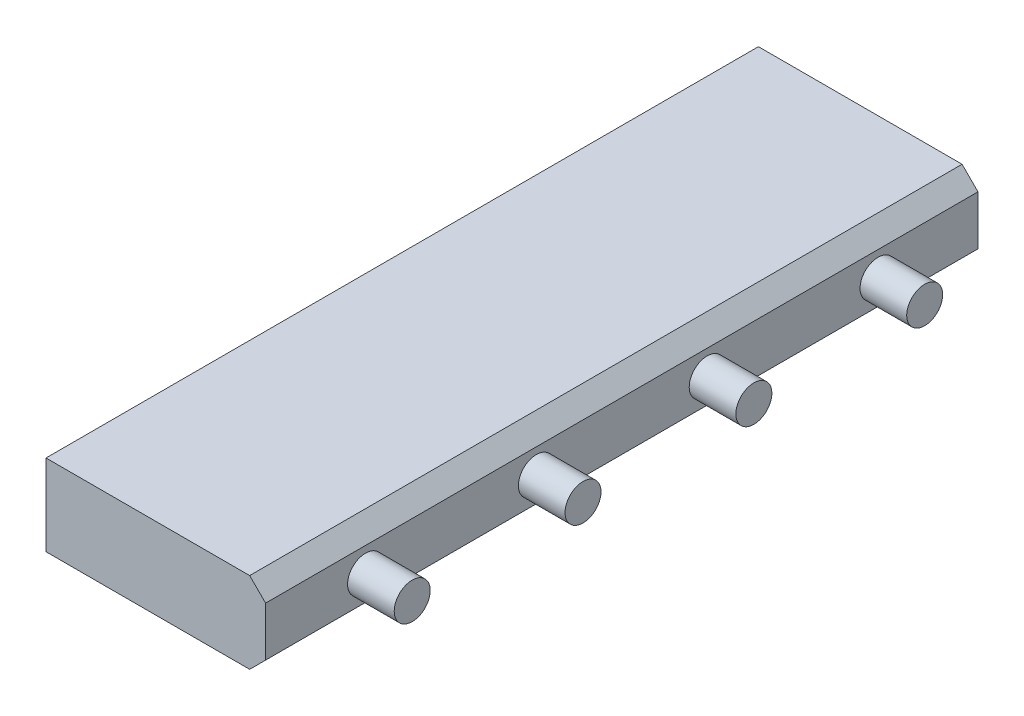
ISO-10303-21;
HEADER;
FILE_DESCRIPTION(('STEP AP214'),'2;1');
FILE_NAME('part.step','',(''),(''),'','','');
FILE_SCHEMA(('AUTOMOTIVE_DESIGN { 1 0 10303 214 1 1 1 1 }'));
ENDSEC;
DATA;
#1=APPLICATION_CONTEXT('core data for automotive mechanical design processes');
#2=APPLICATION_PROTOCOL_DEFINITION('international standard','automotive_design',2000,#1);
#3=PRODUCT_CONTEXT('',#1,'mechanical');
#4=PRODUCT('Part','Part','',(#3));
#5=PRODUCT_RELATED_PRODUCT_CATEGORY('part','',(#4));
#6=PRODUCT_DEFINITION_FORMATION('','',#4);
#7=PRODUCT_DEFINITION_CONTEXT('part definition',#1,'design');
#8=PRODUCT_DEFINITION('design','',#6,#7);
#9=PRODUCT_DEFINITION_SHAPE('','',#8);
#10=(LENGTH_UNIT() NAMED_UNIT(*) SI_UNIT(.MILLI.,.METRE.));
#11=(NAMED_UNIT(*) PLANE_ANGLE_UNIT() SI_UNIT($,.RADIAN.));
#12=(NAMED_UNIT(*) SI_UNIT($,.STERADIAN.) SOLID_ANGLE_UNIT());
#13=UNCERTAINTY_MEASURE_WITH_UNIT(LENGTH_MEASURE(1.E-05),#10,'distance_accuracy_value','');
#14=(GEOMETRIC_REPRESENTATION_CONTEXT(3) GLOBAL_UNCERTAINTY_ASSIGNED_CONTEXT((#13)) GLOBAL_UNIT_ASSIGNED_CONTEXT((#10,
#11,#12)) REPRESENTATION_CONTEXT('',''));
#15=CARTESIAN_POINT('',(0.,0.,0.));
#16=DIRECTION('',(0.,0.,1.));
#17=DIRECTION('',(1.,0.,0.));
#18=AXIS2_PLACEMENT_3D('',#15,#16,#17);
#19=CARTESIAN_POINT('',(0.,0.24375,2.138));
#20=DIRECTION('',(1.,0.,0.));
#21=DIRECTION('',(0.,0.,-1.));
#22=AXIS2_PLACEMENT_3D('',#19,#20,#21);
#23=PLANE('',#22);
#24=DIRECTION('',(0.,-1.,0.));
#25=VECTOR('',#24,1.);
#26=CARTESIAN_POINT('',(0.,0.24375,0.));
#27=LINE('',#26,#25);
#28=CARTESIAN_POINT('',(0.,0.24375,0.));
#29=VERTEX_POINT('',#28);
#30=CARTESIAN_POINT('',(0.,0.,0.));
#31=VERTEX_POINT('',#30);
#32=EDGE_CURVE('E129',#29,#31,#27,.T.);
#33=ORIENTED_EDGE('',*,*,#32,.T.);
#34=DIRECTION('',(0.,0.,-1.));
#35=VECTOR('',#34,1.);
#36=CARTESIAN_POINT('',(0.,0.,2.138));
#37=LINE('',#36,#35);
#38=CARTESIAN_POINT('',(0.,0.,2.138));
#39=VERTEX_POINT('',#38);
#40=EDGE_CURVE('E157',#39,#31,#37,.T.);
#41=ORIENTED_EDGE('',*,*,#40,.F.);
#42=DIRECTION('',(0.,-1.,0.));
#43=VECTOR('',#42,1.);
#44=CARTESIAN_POINT('',(0.,0.24375,2.138));
#45=LINE('',#44,#43);
#46=CARTESIAN_POINT('',(0.,0.24375,2.138));
#47=VERTEX_POINT('',#46);
#48=EDGE_CURVE('E146',#47,#39,#45,.T.);
#49=ORIENTED_EDGE('',*,*,#48,.F.);
#50=DIRECTION('',(0.,0.,-1.));
#51=VECTOR('',#50,1.);
#52=CARTESIAN_POINT('',(0.,0.24375,2.138));
#53=LINE('',#52,#51);
#54=EDGE_CURVE('E125',#47,#29,#53,.T.);
#55=ORIENTED_EDGE('',*,*,#54,.T.);
#56=EDGE_LOOP('',(#33,#41,#49,#55));
#57=FACE_BOUND('',#56,.T.);
#58=ADVANCED_FACE('F39',(#57),#23,.F.);
#59=CARTESIAN_POINT('',(0.,0.,2.138));
#60=DIRECTION('',(0.,1.,0.));
#61=DIRECTION('',(-1.,0.,0.));
#62=AXIS2_PLACEMENT_3D('',#59,#60,#61);
#63=PLANE('',#62);
#64=DIRECTION('',(1.,0.,0.));
#65=VECTOR('',#64,1.);
#66=CARTESIAN_POINT('',(0.,0.,0.));
#67=LINE('',#66,#65);
#68=CARTESIAN_POINT('',(0.61123,0.,0.));
#69=VERTEX_POINT('',#68);
#70=EDGE_CURVE('E133',#31,#69,#67,.T.);
#71=ORIENTED_EDGE('',*,*,#70,.T.);
#72=DIRECTION('',(0.,0.,-1.));
#73=VECTOR('',#72,1.);
#74=CARTESIAN_POINT('',(0.61123,0.,2.138));
#75=LINE('',#74,#73);
#76=CARTESIAN_POINT('',(0.61123,0.,2.138));
#77=VERTEX_POINT('',#76);
#78=EDGE_CURVE('E153',#77,#69,#75,.T.);
#79=ORIENTED_EDGE('',*,*,#78,.F.);
#80=DIRECTION('',(1.,0.,0.));
#81=VECTOR('',#80,1.);
#82=CARTESIAN_POINT('',(0.,0.,2.138));
#83=LINE('',#82,#81);
#84=EDGE_CURVE('E94',#39,#77,#83,.T.);
#85=ORIENTED_EDGE('',*,*,#84,.F.);
#86=ORIENTED_EDGE('',*,*,#40,.T.);
#87=EDGE_LOOP('',(#71,#79,#85,#86));
#88=FACE_BOUND('',#87,.T.);
#89=ADVANCED_FACE('F200',(#88),#63,.F.);
#90=CARTESIAN_POINT('',(0.61123,0.,2.138));
#91=DIRECTION('',(-0.707106781186549,0.707106781186546,0.));
#92=DIRECTION('',(-0.707106781186546,-0.707106781186549,0.));
#93=AXIS2_PLACEMENT_3D('',#90,#91,#92);
#94=PLANE('',#93);
#95=DIRECTION('',(0.707106781186546,0.707106781186549,0.));
#96=VECTOR('',#95,1.);
#97=CARTESIAN_POINT('',(0.61123,0.,0.));
#98=LINE('',#97,#96);
#99=CARTESIAN_POINT('',(0.659,0.0477700000000002,0.));
#100=VERTEX_POINT('',#99);
#101=EDGE_CURVE('E137',#69,#100,#98,.T.);
#102=ORIENTED_EDGE('',*,*,#101,.T.);
#103=DIRECTION('',(0.,0.,-1.));
#104=VECTOR('',#103,1.);
#105=CARTESIAN_POINT('',(0.659,0.0477700000000002,2.138));
#106=LINE('',#105,#104);
#107=CARTESIAN_POINT('',(0.659,0.0477700000000002,2.138));
#108=VERTEX_POINT('',#107);
#109=EDGE_CURVE('E118',#108,#100,#106,.T.);
#110=ORIENTED_EDGE('',*,*,#109,.F.);
#111=DIRECTION('',(0.707106781186546,0.707106781186549,0.));
#112=VECTOR('',#111,1.);
#113=CARTESIAN_POINT('',(0.61123,0.,2.138));
#114=LINE('',#113,#112);
#115=EDGE_CURVE('E107',#77,#108,#114,.T.);
#116=ORIENTED_EDGE('',*,*,#115,.F.);
#117=ORIENTED_EDGE('',*,*,#78,.T.);
#118=EDGE_LOOP('',(#102,#110,#116,#117));
#119=FACE_BOUND('',#118,.T.);
#120=ADVANCED_FACE('F175',(#119),#94,.F.);
#121=CARTESIAN_POINT('',(0.659,0.19598,2.138));
#122=DIRECTION('',(-1.,0.,0.));
#123=DIRECTION('',(0.,0.,1.));
#124=AXIS2_PLACEMENT_3D('',#121,#122,#123);
#125=PLANE('',#124);
#126=CARTESIAN_POINT('',(0.659,0.121875,0.3));
#127=DIRECTION('',(-1.,0.,0.));
#128=DIRECTION('',(0.,0.,1.));
#129=AXIS2_PLACEMENT_3D('',#126,#127,#128);
#130=CIRCLE('',#129,0.0540072996720412);
#131=CARTESIAN_POINT('',(0.659,0.121875,0.354007299672041));
#132=VERTEX_POINT('',#131);
#133=EDGE_CURVE('E11',#132,#132,#130,.F.);
#134=ORIENTED_EDGE('',*,*,#133,.F.);
#135=EDGE_LOOP('',(#134));
#136=FACE_BOUND('',#135,.T.);
#137=CARTESIAN_POINT('',(0.659,0.121875,1.838));
#138=DIRECTION('',(-1.,0.,0.));
#139=DIRECTION('',(0.,0.,1.));
#140=AXIS2_PLACEMENT_3D('',#137,#138,#139);
#141=CIRCLE('',#140,0.054007299672041);
#142=CARTESIAN_POINT('',(0.659,0.121875,1.89200729967204));
#143=VERTEX_POINT('',#142);
#144=EDGE_CURVE('E48',#143,#143,#141,.F.);
#145=ORIENTED_EDGE('',*,*,#144,.F.);
#146=EDGE_LOOP('',(#145));
#147=FACE_BOUND('',#146,.T.);
#148=CARTESIAN_POINT('',(0.659,0.121875,0.812666666666667));
#149=DIRECTION('',(-1.,0.,0.));
#150=DIRECTION('',(0.,0.,1.));
#151=AXIS2_PLACEMENT_3D('',#148,#149,#150);
#152=CIRCLE('',#151,0.0540072996720411);
#153=CARTESIAN_POINT('',(0.659,0.121875,0.866673966338708));
#154=VERTEX_POINT('',#153);
#155=EDGE_CURVE('E164',#154,#154,#152,.F.);
#156=ORIENTED_EDGE('',*,*,#155,.F.);
#157=EDGE_LOOP('',(#156));
#158=FACE_BOUND('',#157,.T.);
#159=CARTESIAN_POINT('',(0.659,0.121875,1.32533333333333));
#160=DIRECTION('',(-1.,0.,0.));
#161=DIRECTION('',(0.,0.,1.));
#162=AXIS2_PLACEMENT_3D('',#159,#160,#161);
#163=CIRCLE('',#162,0.054007299672041);
#164=CARTESIAN_POINT('',(0.659,0.121875,1.37934063300537));
#165=VERTEX_POINT('',#164);
#166=EDGE_CURVE('E160',#165,#165,#163,.F.);
#167=ORIENTED_EDGE('',*,*,#166,.F.);
#168=EDGE_LOOP('',(#167));
#169=FACE_BOUND('',#168,.T.);
#170=DIRECTION('',(0.,1.,0.));
#171=VECTOR('',#170,1.);
#172=CARTESIAN_POINT('',(0.659,0.19598,0.));
#173=LINE('',#172,#171);
#174=CARTESIAN_POINT('',(0.659,0.19598,0.));
#175=VERTEX_POINT('',#174);
#176=EDGE_CURVE('E116',#100,#175,#173,.T.);
#177=ORIENTED_EDGE('',*,*,#176,.T.);
#178=DIRECTION('',(0.,0.,-1.));
#179=VECTOR('',#178,1.);
#180=CARTESIAN_POINT('',(0.659,0.19598,2.138));
#181=LINE('',#180,#179);
#182=CARTESIAN_POINT('',(0.659,0.19598,2.138));
#183=VERTEX_POINT('',#182);
#184=EDGE_CURVE('E113',#183,#175,#181,.T.);
#185=ORIENTED_EDGE('',*,*,#184,.F.);
#186=DIRECTION('',(0.,1.,0.));
#187=VECTOR('',#186,1.);
#188=CARTESIAN_POINT('',(0.659,0.19598,2.138));
#189=LINE('',#188,#187);
#190=EDGE_CURVE('E101',#108,#183,#189,.T.);
#191=ORIENTED_EDGE('',*,*,#190,.F.);
#192=ORIENTED_EDGE('',*,*,#109,.T.);
#193=EDGE_LOOP('',(#177,#185,#191,#192));
#194=FACE_BOUND('',#193,.T.);
#195=ADVANCED_FACE('F114',(#136,#147,#158,#169,#194),#125,.F.);
#196=CARTESIAN_POINT('',(0.61123,0.24375,2.138));
#197=DIRECTION('',(-0.707106781186548,-0.707106781186547,0.));
#198=DIRECTION('',(0.707106781186547,-0.707106781186548,0.));
#199=AXIS2_PLACEMENT_3D('',#196,#197,#198);
#200=PLANE('',#199);
#201=DIRECTION('',(-0.707106781186547,0.707106781186548,0.));
#202=VECTOR('',#201,1.);
#203=CARTESIAN_POINT('',(0.61123,0.24375,0.));
#204=LINE('',#203,#202);
#205=CARTESIAN_POINT('',(0.61123,0.24375,0.));
#206=VERTEX_POINT('',#205);
#207=EDGE_CURVE('E79',#175,#206,#204,.T.);
#208=ORIENTED_EDGE('',*,*,#207,.T.);
#209=DIRECTION('',(0.,0.,-1.));
#210=VECTOR('',#209,1.);
#211=CARTESIAN_POINT('',(0.61123,0.24375,2.138));
#212=LINE('',#211,#210);
#213=CARTESIAN_POINT('',(0.61123,0.24375,2.138));
#214=VERTEX_POINT('',#213);
#215=EDGE_CURVE('E119',#214,#206,#212,.T.);
#216=ORIENTED_EDGE('',*,*,#215,.F.);
#217=DIRECTION('',(-0.707106781186547,0.707106781186548,0.));
#218=VECTOR('',#217,1.);
#219=CARTESIAN_POINT('',(0.61123,0.24375,2.138));
#220=LINE('',#219,#218);
#221=EDGE_CURVE('E105',#183,#214,#220,.T.);
#222=ORIENTED_EDGE('',*,*,#221,.F.);
#223=ORIENTED_EDGE('',*,*,#184,.T.);
#224=EDGE_LOOP('',(#208,#216,#222,#223));
#225=FACE_BOUND('',#224,.T.);
#226=ADVANCED_FACE('F121',(#225),#200,.F.);
#227=CARTESIAN_POINT('',(0.,0.24375,2.138));
#228=DIRECTION('',(0.,-1.,0.));
#229=DIRECTION('',(0.,0.,-1.));
#230=AXIS2_PLACEMENT_3D('',#227,#228,#229);
#231=PLANE('',#230);
#232=DIRECTION('',(-1.,0.,0.));
#233=VECTOR('',#232,1.);
#234=CARTESIAN_POINT('',(0.,0.24375,0.));
#235=LINE('',#234,#233);
#236=EDGE_CURVE('E85',#206,#29,#235,.T.);
#237=ORIENTED_EDGE('',*,*,#236,.T.);
#238=ORIENTED_EDGE('',*,*,#54,.F.);
#239=DIRECTION('',(-1.,0.,0.));
#240=VECTOR('',#239,1.);
#241=CARTESIAN_POINT('',(0.,0.24375,2.138));
#242=LINE('',#241,#240);
#243=EDGE_CURVE('E56',#214,#47,#242,.T.);
#244=ORIENTED_EDGE('',*,*,#243,.F.);
#245=ORIENTED_EDGE('',*,*,#215,.T.);
#246=EDGE_LOOP('',(#237,#238,#244,#245));
#247=FACE_BOUND('',#246,.T.);
#248=ADVANCED_FACE('F315',(#247),#231,.F.);
#249=CARTESIAN_POINT('',(0.,0.,2.138));
#250=DIRECTION('',(0.,0.,1.));
#251=DIRECTION('',(1.,0.,0.));
#252=AXIS2_PLACEMENT_3D('',#249,#250,#251);
#253=PLANE('',#252);
#254=ORIENTED_EDGE('',*,*,#48,.T.);
#255=ORIENTED_EDGE('',*,*,#84,.T.);
#256=ORIENTED_EDGE('',*,*,#115,.T.);
#257=ORIENTED_EDGE('',*,*,#190,.T.);
#258=ORIENTED_EDGE('',*,*,#221,.T.);
#259=ORIENTED_EDGE('',*,*,#243,.T.);
#260=EDGE_LOOP('',(#254,#255,#256,#257,#258,#259));
#261=FACE_BOUND('',#260,.T.);
#262=ADVANCED_FACE('F103',(#261),#253,.T.);
#263=CARTESIAN_POINT('',(0.,0.,0.));
#264=DIRECTION('',(0.,0.,1.));
#265=DIRECTION('',(1.,0.,0.));
#266=AXIS2_PLACEMENT_3D('',#263,#264,#265);
#267=PLANE('',#266);
#268=ORIENTED_EDGE('',*,*,#32,.F.);
#269=ORIENTED_EDGE('',*,*,#236,.F.);
#270=ORIENTED_EDGE('',*,*,#207,.F.);
#271=ORIENTED_EDGE('',*,*,#176,.F.);
#272=ORIENTED_EDGE('',*,*,#101,.F.);
#273=ORIENTED_EDGE('',*,*,#70,.F.);
#274=EDGE_LOOP('',(#268,#269,#270,#271,#272,#273));
#275=FACE_BOUND('',#274,.T.);
#276=ADVANCED_FACE('F185',(#275),#267,.F.);
#277=CARTESIAN_POINT('',(0.799,0.121875,1.32533333333333));
#278=DIRECTION('',(-1.,0.,0.));
#279=DIRECTION('',(0.,0.,1.));
#280=AXIS2_PLACEMENT_3D('',#277,#278,#279);
#281=CYLINDRICAL_SURFACE('',#280,0.054007299672041);
#282=CARTESIAN_POINT('',(0.799,0.121875,1.32533333333333));
#283=DIRECTION('',(1.,0.,0.));
#284=DIRECTION('',(0.,0.,-1.));
#285=AXIS2_PLACEMENT_3D('',#282,#283,#284);
#286=CIRCLE('',#285,0.054007299672041);
#287=CARTESIAN_POINT('',(0.799,0.121875,1.27132603366129));
#288=VERTEX_POINT('',#287);
#289=EDGE_CURVE('E134',#288,#288,#286,.T.);
#290=ORIENTED_EDGE('',*,*,#289,.F.);
#291=EDGE_LOOP('',(#290));
#292=FACE_BOUND('',#291,.T.);
#293=ORIENTED_EDGE('',*,*,#166,.T.);
#294=EDGE_LOOP('',(#293));
#295=FACE_BOUND('',#294,.T.);
#296=ADVANCED_FACE('F182',(#292,#295),#281,.T.);
#297=CARTESIAN_POINT('',(0.799,0.121875,1.32533333333333));
#298=DIRECTION('',(1.,0.,0.));
#299=DIRECTION('',(0.,0.,-1.));
#300=AXIS2_PLACEMENT_3D('',#297,#298,#299);
#301=PLANE('',#300);
#302=ORIENTED_EDGE('',*,*,#289,.T.);
#303=EDGE_LOOP('',(#302));
#304=FACE_BOUND('',#303,.T.);
#305=ADVANCED_FACE('F184',(#304),#301,.T.);
#306=CARTESIAN_POINT('',(0.799,0.121875,0.812666666666667));
#307=DIRECTION('',(-1.,0.,0.));
#308=DIRECTION('',(0.,0.,1.));
#309=AXIS2_PLACEMENT_3D('',#306,#307,#308);
#310=CYLINDRICAL_SURFACE('',#309,0.0540072996720411);
#311=CARTESIAN_POINT('',(0.799,0.121875,0.812666666666667));
#312=DIRECTION('',(1.,0.,0.));
#313=DIRECTION('',(0.,0.,-1.));
#314=AXIS2_PLACEMENT_3D('',#311,#312,#313);
#315=CIRCLE('',#314,0.0540072996720411);
#316=CARTESIAN_POINT('',(0.799,0.121875,0.758659366994626));
#317=VERTEX_POINT('',#316);
#318=EDGE_CURVE('E219',#317,#317,#315,.T.);
#319=ORIENTED_EDGE('',*,*,#318,.F.);
#320=EDGE_LOOP('',(#319));
#321=FACE_BOUND('',#320,.T.);
#322=ORIENTED_EDGE('',*,*,#155,.T.);
#323=EDGE_LOOP('',(#322));
#324=FACE_BOUND('',#323,.T.);
#325=ADVANCED_FACE('F192',(#321,#324),#310,.T.);
#326=CARTESIAN_POINT('',(0.799,0.121875,0.812666666666667));
#327=DIRECTION('',(1.,0.,0.));
#328=DIRECTION('',(0.,0.,-1.));
#329=AXIS2_PLACEMENT_3D('',#326,#327,#328);
#330=PLANE('',#329);
#331=ORIENTED_EDGE('',*,*,#318,.T.);
#332=EDGE_LOOP('',(#331));
#333=FACE_BOUND('',#332,.T.);
#334=ADVANCED_FACE('F250',(#333),#330,.T.);
#335=CARTESIAN_POINT('',(0.799,0.121875,1.838));
#336=DIRECTION('',(-1.,0.,0.));
#337=DIRECTION('',(0.,0.,1.));
#338=AXIS2_PLACEMENT_3D('',#335,#336,#337);
#339=CYLINDRICAL_SURFACE('',#338,0.054007299672041);
#340=CARTESIAN_POINT('',(0.799,0.121875,1.838));
#341=DIRECTION('',(1.,0.,0.));
#342=DIRECTION('',(0.,0.,-1.));
#343=AXIS2_PLACEMENT_3D('',#340,#341,#342);
#344=CIRCLE('',#343,0.054007299672041);
#345=CARTESIAN_POINT('',(0.799,0.121875,1.78399270032796));
#346=VERTEX_POINT('',#345);
#347=EDGE_CURVE('E223',#346,#346,#344,.T.);
#348=ORIENTED_EDGE('',*,*,#347,.F.);
#349=EDGE_LOOP('',(#348));
#350=FACE_BOUND('',#349,.T.);
#351=ORIENTED_EDGE('',*,*,#144,.T.);
#352=EDGE_LOOP('',(#351));
#353=FACE_BOUND('',#352,.T.);
#354=ADVANCED_FACE('F171',(#350,#353),#339,.T.);
#355=CARTESIAN_POINT('',(0.799,0.121875,1.838));
#356=DIRECTION('',(1.,0.,0.));
#357=DIRECTION('',(0.,0.,-1.));
#358=AXIS2_PLACEMENT_3D('',#355,#356,#357);
#359=PLANE('',#358);
#360=ORIENTED_EDGE('',*,*,#347,.T.);
#361=EDGE_LOOP('',(#360));
#362=FACE_BOUND('',#361,.T.);
#363=ADVANCED_FACE('F237',(#362),#359,.T.);
#364=CARTESIAN_POINT('',(0.799,0.121875,0.3));
#365=DIRECTION('',(-1.,0.,0.));
#366=DIRECTION('',(0.,0.,1.));
#367=AXIS2_PLACEMENT_3D('',#364,#365,#366);
#368=CYLINDRICAL_SURFACE('',#367,0.0540072996720412);
#369=CARTESIAN_POINT('',(0.799,0.121875,0.3));
#370=DIRECTION('',(1.,0.,0.));
#371=DIRECTION('',(0.,0.,-1.));
#372=AXIS2_PLACEMENT_3D('',#369,#370,#371);
#373=CIRCLE('',#372,0.0540072996720412);
#374=CARTESIAN_POINT('',(0.799,0.121875,0.245992700327959));
#375=VERTEX_POINT('',#374);
#376=EDGE_CURVE('E227',#375,#375,#373,.T.);
#377=ORIENTED_EDGE('',*,*,#376,.F.);
#378=EDGE_LOOP('',(#377));
#379=FACE_BOUND('',#378,.T.);
#380=ORIENTED_EDGE('',*,*,#133,.T.);
#381=EDGE_LOOP('',(#380));
#382=FACE_BOUND('',#381,.T.);
#383=ADVANCED_FACE('F234',(#379,#382),#368,.T.);
#384=CARTESIAN_POINT('',(0.799,0.121875,0.3));
#385=DIRECTION('',(1.,0.,0.));
#386=DIRECTION('',(0.,0.,-1.));
#387=AXIS2_PLACEMENT_3D('',#384,#385,#386);
#388=PLANE('',#387);
#389=ORIENTED_EDGE('',*,*,#376,.T.);
#390=EDGE_LOOP('',(#389));
#391=FACE_BOUND('',#390,.T.);
#392=ADVANCED_FACE('F232',(#391),#388,.T.);
#393=CLOSED_SHELL('',(#58,#89,#120,#195,#226,#248,#262,#276,#296,#305,#325,#334,#354,#363,#383,#392));
#394=MANIFOLD_SOLID_BREP('B2',#393);
#395=ADVANCED_BREP_SHAPE_REPRESENTATION('',(#18,#394),#14);
#396=SHAPE_DEFINITION_REPRESENTATION(#9,#395);
ENDSEC;
END-ISO-10303-21;
